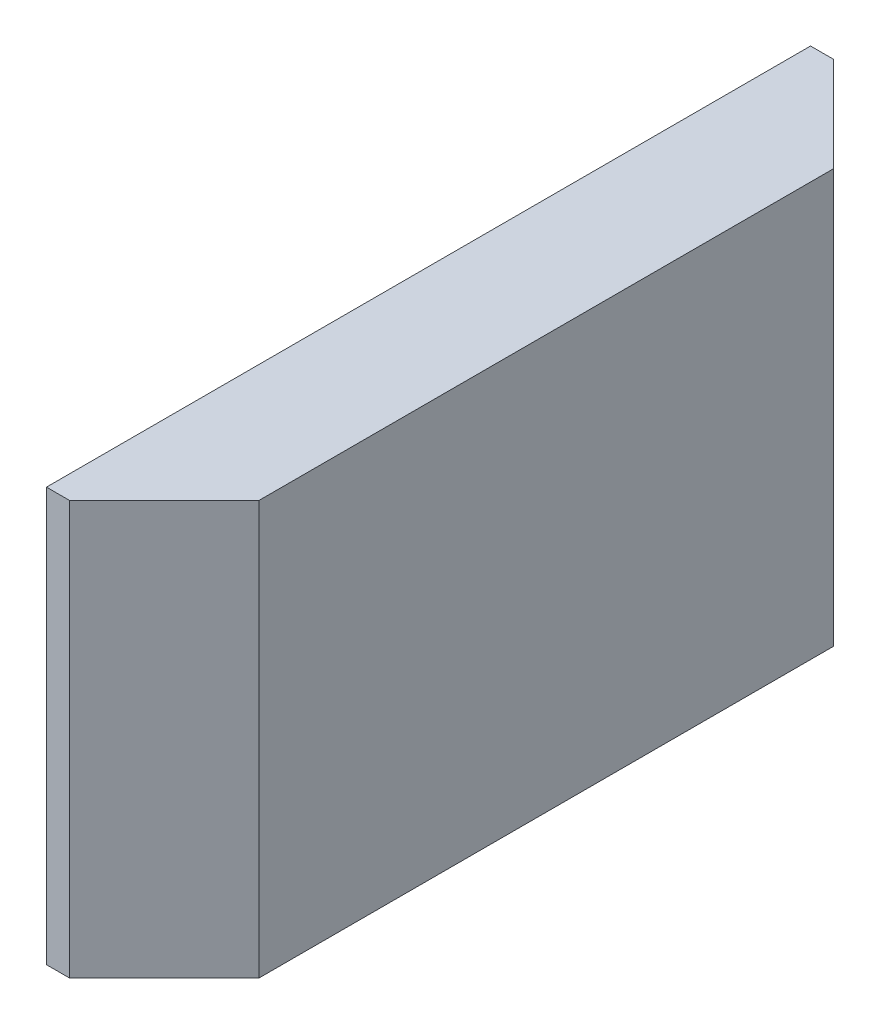
ISO-10303-21;
HEADER;
FILE_DESCRIPTION(('STEP AP214'),'2;1');
FILE_NAME('part.step','',(''),(''),'','','');
FILE_SCHEMA(('AUTOMOTIVE_DESIGN { 1 0 10303 214 1 1 1 1 }'));
ENDSEC;
DATA;
#1=APPLICATION_CONTEXT('core data for automotive mechanical design processes');
#2=APPLICATION_PROTOCOL_DEFINITION('international standard','automotive_design',2000,#1);
#3=PRODUCT_CONTEXT('',#1,'mechanical');
#4=PRODUCT('Part','Part','',(#3));
#5=PRODUCT_RELATED_PRODUCT_CATEGORY('part','',(#4));
#6=PRODUCT_DEFINITION_FORMATION('','',#4);
#7=PRODUCT_DEFINITION_CONTEXT('part definition',#1,'design');
#8=PRODUCT_DEFINITION('design','',#6,#7);
#9=PRODUCT_DEFINITION_SHAPE('','',#8);
#10=(LENGTH_UNIT() NAMED_UNIT(*) SI_UNIT(.MILLI.,.METRE.));
#11=(NAMED_UNIT(*) PLANE_ANGLE_UNIT() SI_UNIT($,.RADIAN.));
#12=(NAMED_UNIT(*) SI_UNIT($,.STERADIAN.) SOLID_ANGLE_UNIT());
#13=UNCERTAINTY_MEASURE_WITH_UNIT(LENGTH_MEASURE(1.E-05),#10,'distance_accuracy_value','');
#14=(GEOMETRIC_REPRESENTATION_CONTEXT(3) GLOBAL_UNCERTAINTY_ASSIGNED_CONTEXT((#13)) GLOBAL_UNIT_ASSIGNED_CONTEXT((#10,
#11,#12)) REPRESENTATION_CONTEXT('',''));
#15=CARTESIAN_POINT('',(0.,0.,0.));
#16=DIRECTION('',(0.,0.,1.));
#17=DIRECTION('',(1.,0.,0.));
#18=AXIS2_PLACEMENT_3D('',#15,#16,#17);
#19=CARTESIAN_POINT('',(-41.,144.,133.));
#20=DIRECTION('',(0.,0.,-1.));
#21=DIRECTION('',(-1.,0.,0.));
#22=AXIS2_PLACEMENT_3D('',#19,#20,#21);
#23=PLANE('',#22);
#24=DIRECTION('',(1.,0.,0.));
#25=VECTOR('',#24,1.);
#26=CARTESIAN_POINT('',(-41.,0.,133.));
#27=LINE('',#26,#25);
#28=CARTESIAN_POINT('',(-41.,0.,133.));
#29=VERTEX_POINT('',#28);
#30=CARTESIAN_POINT('',(-33.,0.,133.));
#31=VERTEX_POINT('',#30);
#32=EDGE_CURVE('E116',#29,#31,#27,.T.);
#33=ORIENTED_EDGE('',*,*,#32,.T.);
#34=DIRECTION('',(0.,-1.,0.));
#35=VECTOR('',#34,1.);
#36=CARTESIAN_POINT('',(-33.,144.,133.));
#37=LINE('',#36,#35);
#38=CARTESIAN_POINT('',(-33.,144.,133.));
#39=VERTEX_POINT('',#38);
#40=EDGE_CURVE('E11',#39,#31,#37,.T.);
#41=ORIENTED_EDGE('',*,*,#40,.F.);
#42=DIRECTION('',(1.,0.,0.));
#43=VECTOR('',#42,1.);
#44=CARTESIAN_POINT('',(-41.,144.,133.));
#45=LINE('',#44,#43);
#46=CARTESIAN_POINT('',(-41.,144.,133.));
#47=VERTEX_POINT('',#46);
#48=EDGE_CURVE('E126',#47,#39,#45,.T.);
#49=ORIENTED_EDGE('',*,*,#48,.F.);
#50=DIRECTION('',(0.,-1.,0.));
#51=VECTOR('',#50,1.);
#52=CARTESIAN_POINT('',(-41.,144.,133.));
#53=LINE('',#52,#51);
#54=EDGE_CURVE('E112',#47,#29,#53,.T.);
#55=ORIENTED_EDGE('',*,*,#54,.T.);
#56=EDGE_LOOP('',(#33,#41,#49,#55));
#57=FACE_BOUND('',#56,.T.);
#58=ADVANCED_FACE('F32',(#57),#23,.F.);
#59=CARTESIAN_POINT('',(0.,144.,99.9999999999992));
#60=DIRECTION('',(-0.707106781186556,0.,-0.707106781186539));
#61=DIRECTION('',(-0.707106781186539,0.,0.707106781186556));
#62=AXIS2_PLACEMENT_3D('',#59,#60,#61);
#63=PLANE('',#62);
#64=DIRECTION('',(0.707106781186539,0.,-0.707106781186556));
#65=VECTOR('',#64,1.);
#66=CARTESIAN_POINT('',(0.,0.,99.9999999999992));
#67=LINE('',#66,#65);
#68=CARTESIAN_POINT('',(0.,0.,99.9999999999992));
#69=VERTEX_POINT('',#68);
#70=EDGE_CURVE('E119',#31,#69,#67,.T.);
#71=ORIENTED_EDGE('',*,*,#70,.T.);
#72=DIRECTION('',(0.,-1.,0.));
#73=VECTOR('',#72,1.);
#74=CARTESIAN_POINT('',(0.,144.,99.9999999999992));
#75=LINE('',#74,#73);
#76=CARTESIAN_POINT('',(0.,144.,99.9999999999992));
#77=VERTEX_POINT('',#76);
#78=EDGE_CURVE('E40',#77,#69,#75,.T.);
#79=ORIENTED_EDGE('',*,*,#78,.F.);
#80=DIRECTION('',(0.707106781186539,0.,-0.707106781186556));
#81=VECTOR('',#80,1.);
#82=CARTESIAN_POINT('',(0.,144.,99.9999999999992));
#83=LINE('',#82,#81);
#84=EDGE_CURVE('E85',#39,#77,#83,.T.);
#85=ORIENTED_EDGE('',*,*,#84,.F.);
#86=ORIENTED_EDGE('',*,*,#40,.T.);
#87=EDGE_LOOP('',(#71,#79,#85,#86));
#88=FACE_BOUND('',#87,.T.);
#89=ADVANCED_FACE('F150',(#88),#63,.F.);
#90=CARTESIAN_POINT('',(0.,144.,-99.9999999999992));
#91=DIRECTION('',(-1.,0.,0.));
#92=DIRECTION('',(0.,0.,1.));
#93=AXIS2_PLACEMENT_3D('',#90,#91,#92);
#94=PLANE('',#93);
#95=DIRECTION('',(0.,0.,-1.));
#96=VECTOR('',#95,1.);
#97=CARTESIAN_POINT('',(0.,0.,-99.9999999999992));
#98=LINE('',#97,#96);
#99=CARTESIAN_POINT('',(0.,0.,-99.9999999999992));
#100=VERTEX_POINT('',#99);
#101=EDGE_CURVE('E121',#69,#100,#98,.T.);
#102=ORIENTED_EDGE('',*,*,#101,.T.);
#103=DIRECTION('',(0.,-1.,0.));
#104=VECTOR('',#103,1.);
#105=CARTESIAN_POINT('',(0.,144.,-99.9999999999992));
#106=LINE('',#105,#104);
#107=CARTESIAN_POINT('',(0.,144.,-99.9999999999992));
#108=VERTEX_POINT('',#107);
#109=EDGE_CURVE('E107',#108,#100,#106,.T.);
#110=ORIENTED_EDGE('',*,*,#109,.F.);
#111=DIRECTION('',(0.,0.,-1.));
#112=VECTOR('',#111,1.);
#113=CARTESIAN_POINT('',(0.,144.,-99.9999999999992));
#114=LINE('',#113,#112);
#115=EDGE_CURVE('E98',#77,#108,#114,.T.);
#116=ORIENTED_EDGE('',*,*,#115,.F.);
#117=ORIENTED_EDGE('',*,*,#78,.T.);
#118=EDGE_LOOP('',(#102,#110,#116,#117));
#119=FACE_BOUND('',#118,.T.);
#120=ADVANCED_FACE('F132',(#119),#94,.F.);
#121=CARTESIAN_POINT('',(0.,144.,-99.9999999999992));
#122=DIRECTION('',(-0.707106781186556,0.,0.707106781186539));
#123=DIRECTION('',(0.707106781186539,0.,0.707106781186556));
#124=AXIS2_PLACEMENT_3D('',#121,#122,#123);
#125=PLANE('',#124);
#126=DIRECTION('',(-0.707106781186539,0.,-0.707106781186556));
#127=VECTOR('',#126,1.);
#128=CARTESIAN_POINT('',(0.,0.,-99.9999999999992));
#129=LINE('',#128,#127);
#130=CARTESIAN_POINT('',(-33.,0.,-133.));
#131=VERTEX_POINT('',#130);
#132=EDGE_CURVE('E106',#100,#131,#129,.T.);
#133=ORIENTED_EDGE('',*,*,#132,.T.);
#134=DIRECTION('',(0.,-1.,0.));
#135=VECTOR('',#134,1.);
#136=CARTESIAN_POINT('',(-33.,144.,-133.));
#137=LINE('',#136,#135);
#138=CARTESIAN_POINT('',(-33.,144.,-133.));
#139=VERTEX_POINT('',#138);
#140=EDGE_CURVE('E103',#139,#131,#137,.T.);
#141=ORIENTED_EDGE('',*,*,#140,.F.);
#142=DIRECTION('',(-0.707106781186539,0.,-0.707106781186556));
#143=VECTOR('',#142,1.);
#144=CARTESIAN_POINT('',(0.,144.,-99.9999999999992));
#145=LINE('',#144,#143);
#146=EDGE_CURVE('E92',#108,#139,#145,.T.);
#147=ORIENTED_EDGE('',*,*,#146,.F.);
#148=ORIENTED_EDGE('',*,*,#109,.T.);
#149=EDGE_LOOP('',(#133,#141,#147,#148));
#150=FACE_BOUND('',#149,.T.);
#151=ADVANCED_FACE('F104',(#150),#125,.F.);
#152=CARTESIAN_POINT('',(-41.,144.,-133.));
#153=DIRECTION('',(0.,0.,1.));
#154=DIRECTION('',(1.,0.,0.));
#155=AXIS2_PLACEMENT_3D('',#152,#153,#154);
#156=PLANE('',#155);
#157=DIRECTION('',(-1.,0.,0.));
#158=VECTOR('',#157,1.);
#159=CARTESIAN_POINT('',(-41.,0.,-133.));
#160=LINE('',#159,#158);
#161=CARTESIAN_POINT('',(-41.,0.,-133.));
#162=VERTEX_POINT('',#161);
#163=EDGE_CURVE('E71',#131,#162,#160,.T.);
#164=ORIENTED_EDGE('',*,*,#163,.T.);
#165=DIRECTION('',(0.,-1.,0.));
#166=VECTOR('',#165,1.);
#167=CARTESIAN_POINT('',(-41.,144.,-133.));
#168=LINE('',#167,#166);
#169=CARTESIAN_POINT('',(-41.,144.,-133.));
#170=VERTEX_POINT('',#169);
#171=EDGE_CURVE('E108',#170,#162,#168,.T.);
#172=ORIENTED_EDGE('',*,*,#171,.F.);
#173=DIRECTION('',(-1.,0.,0.));
#174=VECTOR('',#173,1.);
#175=CARTESIAN_POINT('',(-41.,144.,-133.));
#176=LINE('',#175,#174);
#177=EDGE_CURVE('E96',#139,#170,#176,.T.);
#178=ORIENTED_EDGE('',*,*,#177,.F.);
#179=ORIENTED_EDGE('',*,*,#140,.T.);
#180=EDGE_LOOP('',(#164,#172,#178,#179));
#181=FACE_BOUND('',#180,.T.);
#182=ADVANCED_FACE('F110',(#181),#156,.F.);
#183=CARTESIAN_POINT('',(-41.,144.,-133.));
#184=DIRECTION('',(1.,0.,0.));
#185=DIRECTION('',(0.,0.,-1.));
#186=AXIS2_PLACEMENT_3D('',#183,#184,#185);
#187=PLANE('',#186);
#188=DIRECTION('',(0.,0.,1.));
#189=VECTOR('',#188,1.);
#190=CARTESIAN_POINT('',(-41.,0.,-133.));
#191=LINE('',#190,#189);
#192=EDGE_CURVE('E77',#162,#29,#191,.T.);
#193=ORIENTED_EDGE('',*,*,#192,.T.);
#194=ORIENTED_EDGE('',*,*,#54,.F.);
#195=DIRECTION('',(0.,0.,1.));
#196=VECTOR('',#195,1.);
#197=CARTESIAN_POINT('',(-41.,144.,-133.));
#198=LINE('',#197,#196);
#199=EDGE_CURVE('E48',#170,#47,#198,.T.);
#200=ORIENTED_EDGE('',*,*,#199,.F.);
#201=ORIENTED_EDGE('',*,*,#171,.T.);
#202=EDGE_LOOP('',(#193,#194,#200,#201));
#203=FACE_BOUND('',#202,.T.);
#204=ADVANCED_FACE('F139',(#203),#187,.F.);
#205=CARTESIAN_POINT('',(0.,144.,0.));
#206=DIRECTION('',(0.,-1.,0.));
#207=DIRECTION('',(0.,0.,-1.));
#208=AXIS2_PLACEMENT_3D('',#205,#206,#207);
#209=PLANE('',#208);
#210=ORIENTED_EDGE('',*,*,#48,.T.);
#211=ORIENTED_EDGE('',*,*,#84,.T.);
#212=ORIENTED_EDGE('',*,*,#115,.T.);
#213=ORIENTED_EDGE('',*,*,#146,.T.);
#214=ORIENTED_EDGE('',*,*,#177,.T.);
#215=ORIENTED_EDGE('',*,*,#199,.T.);
#216=EDGE_LOOP('',(#210,#211,#212,#213,#214,#215));
#217=FACE_BOUND('',#216,.T.);
#218=ADVANCED_FACE('F94',(#217),#209,.F.);
#219=CARTESIAN_POINT('',(0.,0.,0.));
#220=DIRECTION('',(0.,-1.,0.));
#221=DIRECTION('',(0.,0.,-1.));
#222=AXIS2_PLACEMENT_3D('',#219,#220,#221);
#223=PLANE('',#222);
#224=ORIENTED_EDGE('',*,*,#32,.F.);
#225=ORIENTED_EDGE('',*,*,#192,.F.);
#226=ORIENTED_EDGE('',*,*,#163,.F.);
#227=ORIENTED_EDGE('',*,*,#132,.F.);
#228=ORIENTED_EDGE('',*,*,#101,.F.);
#229=ORIENTED_EDGE('',*,*,#70,.F.);
#230=EDGE_LOOP('',(#224,#225,#226,#227,#228,#229));
#231=FACE_BOUND('',#230,.T.);
#232=ADVANCED_FACE('F135',(#231),#223,.T.);
#233=CLOSED_SHELL('',(#58,#89,#120,#151,#182,#204,#218,#232));
#234=MANIFOLD_SOLID_BREP('B2',#233);
#235=ADVANCED_BREP_SHAPE_REPRESENTATION('',(#18,#234),#14);
#236=SHAPE_DEFINITION_REPRESENTATION(#9,#235);
ENDSEC;
END-ISO-10303-21;
